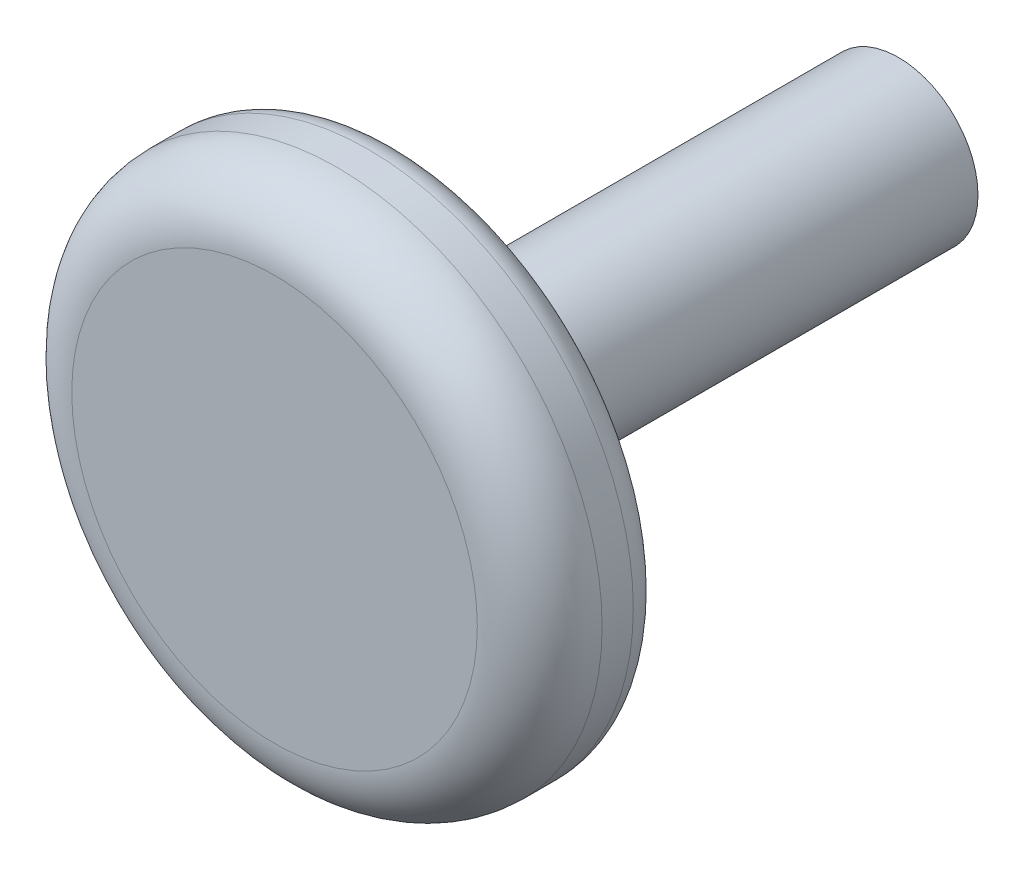
ISO-10303-21;
HEADER;
FILE_DESCRIPTION(('STEP AP214'),'2;1');
FILE_NAME('part.step','',(''),(''),'','','');
FILE_SCHEMA(('AUTOMOTIVE_DESIGN { 1 0 10303 214 1 1 1 1 }'));
ENDSEC;
DATA;
#1=APPLICATION_CONTEXT('core data for automotive mechanical design processes');
#2=APPLICATION_PROTOCOL_DEFINITION('international standard','automotive_design',2000,#1);
#3=PRODUCT_CONTEXT('',#1,'mechanical');
#4=PRODUCT('Part','Part','',(#3));
#5=PRODUCT_RELATED_PRODUCT_CATEGORY('part','',(#4));
#6=PRODUCT_DEFINITION_FORMATION('','',#4);
#7=PRODUCT_DEFINITION_CONTEXT('part definition',#1,'design');
#8=PRODUCT_DEFINITION('design','',#6,#7);
#9=PRODUCT_DEFINITION_SHAPE('','',#8);
#10=(LENGTH_UNIT() NAMED_UNIT(*) SI_UNIT(.MILLI.,.METRE.));
#11=(NAMED_UNIT(*) PLANE_ANGLE_UNIT() SI_UNIT($,.RADIAN.));
#12=(NAMED_UNIT(*) SI_UNIT($,.STERADIAN.) SOLID_ANGLE_UNIT());
#13=UNCERTAINTY_MEASURE_WITH_UNIT(LENGTH_MEASURE(1.E-05),#10,'distance_accuracy_value','');
#14=(GEOMETRIC_REPRESENTATION_CONTEXT(3) GLOBAL_UNCERTAINTY_ASSIGNED_CONTEXT((#13)) GLOBAL_UNIT_ASSIGNED_CONTEXT((#10,
#11,#12)) REPRESENTATION_CONTEXT('',''));
#15=CARTESIAN_POINT('',(0.,0.,0.));
#16=DIRECTION('',(0.,0.,1.));
#17=DIRECTION('',(1.,0.,0.));
#18=AXIS2_PLACEMENT_3D('',#15,#16,#17);
#19=CARTESIAN_POINT('',(0.,0.,80.));
#20=DIRECTION('',(0.,0.,-1.));
#21=DIRECTION('',(-1.,0.,0.));
#22=AXIS2_PLACEMENT_3D('',#19,#20,#21);
#23=CYLINDRICAL_SURFACE('',#22,12.75);
#24=CARTESIAN_POINT('',(0.,0.,70.));
#25=DIRECTION('',(0.,0.,1.));
#26=DIRECTION('',(1.,0.,0.));
#27=AXIS2_PLACEMENT_3D('',#24,#25,#26);
#28=CIRCLE('',#27,12.75);
#29=CARTESIAN_POINT('',(12.75,0.,70.));
#30=VERTEX_POINT('',#29);
#31=EDGE_CURVE('E42',#30,#30,#28,.F.);
#32=ORIENTED_EDGE('',*,*,#31,.T.);
#33=EDGE_LOOP('',(#32));
#34=FACE_BOUND('',#33,.T.);
#35=CARTESIAN_POINT('',(0.,0.,0.));
#36=DIRECTION('',(0.,0.,1.));
#37=DIRECTION('',(1.,0.,0.));
#38=AXIS2_PLACEMENT_3D('',#35,#36,#37);
#39=CIRCLE('',#38,12.75);
#40=CARTESIAN_POINT('',(12.75,0.,0.));
#41=VERTEX_POINT('',#40);
#42=EDGE_CURVE('E57',#41,#41,#39,.T.);
#43=ORIENTED_EDGE('',*,*,#42,.T.);
#44=EDGE_LOOP('',(#43));
#45=FACE_BOUND('',#44,.T.);
#46=ADVANCED_FACE('F31',(#34,#45),#23,.T.);
#47=CARTESIAN_POINT('',(0.,0.,0.));
#48=DIRECTION('',(0.,0.,1.));
#49=DIRECTION('',(1.,0.,0.));
#50=AXIS2_PLACEMENT_3D('',#47,#48,#49);
#51=PLANE('',#50);
#52=CARTESIAN_POINT('',(0.,0.,0.));
#53=DIRECTION('',(0.,0.,-1.));
#54=DIRECTION('',(-1.,0.,0.));
#55=AXIS2_PLACEMENT_3D('',#52,#53,#54);
#56=CIRCLE('',#55,10.25);
#57=CARTESIAN_POINT('',(-10.25,0.,0.));
#58=VERTEX_POINT('',#57);
#59=EDGE_CURVE('E61',#58,#58,#56,.T.);
#60=ORIENTED_EDGE('',*,*,#59,.F.);
#61=EDGE_LOOP('',(#60));
#62=FACE_BOUND('',#61,.T.);
#63=ORIENTED_EDGE('',*,*,#42,.F.);
#64=EDGE_LOOP('',(#63));
#65=FACE_BOUND('',#64,.T.);
#66=ADVANCED_FACE('F76',(#62,#65),#51,.F.);
#67=CARTESIAN_POINT('',(0.,0.,100.));
#68=DIRECTION('',(0.,0.,-1.));
#69=DIRECTION('',(-1.,0.,0.));
#70=AXIS2_PLACEMENT_3D('',#67,#68,#69);
#71=CYLINDRICAL_SURFACE('',#70,42.5);
#72=CARTESIAN_POINT('',(0.,0.,85.));
#73=DIRECTION('',(0.,0.,1.));
#74=DIRECTION('',(1.,0.,0.));
#75=AXIS2_PLACEMENT_3D('',#72,#73,#74);
#76=CIRCLE('',#75,42.5);
#77=CARTESIAN_POINT('',(42.5,0.,85.));
#78=VERTEX_POINT('',#77);
#79=EDGE_CURVE('E38',#78,#78,#76,.T.);
#80=ORIENTED_EDGE('',*,*,#79,.T.);
#81=EDGE_LOOP('',(#80));
#82=FACE_BOUND('',#81,.T.);
#83=CARTESIAN_POINT('',(0.,0.,90.));
#84=DIRECTION('',(0.,0.,1.));
#85=DIRECTION('',(1.,0.,0.));
#86=AXIS2_PLACEMENT_3D('',#83,#84,#85);
#87=CIRCLE('',#86,42.5);
#88=CARTESIAN_POINT('',(42.5,0.,90.));
#89=VERTEX_POINT('',#88);
#90=EDGE_CURVE('E51',#89,#89,#87,.F.);
#91=ORIENTED_EDGE('',*,*,#90,.T.);
#92=EDGE_LOOP('',(#91));
#93=FACE_BOUND('',#92,.T.);
#94=ADVANCED_FACE('F79',(#82,#93),#71,.T.);
#95=CARTESIAN_POINT('',(0.,0.,100.));
#96=DIRECTION('',(0.,0.,1.));
#97=DIRECTION('',(1.,0.,0.));
#98=AXIS2_PLACEMENT_3D('',#95,#96,#97);
#99=PLANE('',#98);
#100=CARTESIAN_POINT('',(0.,0.,100.));
#101=DIRECTION('',(0.,0.,1.));
#102=DIRECTION('',(1.,0.,0.));
#103=AXIS2_PLACEMENT_3D('',#100,#101,#102);
#104=CIRCLE('',#103,32.5);
#105=CARTESIAN_POINT('',(32.5,0.,100.));
#106=VERTEX_POINT('',#105);
#107=EDGE_CURVE('E54',#106,#106,#104,.T.);
#108=ORIENTED_EDGE('',*,*,#107,.T.);
#109=EDGE_LOOP('',(#108));
#110=FACE_BOUND('',#109,.T.);
#111=ADVANCED_FACE('F107',(#110),#99,.T.);
#112=CARTESIAN_POINT('',(0.,0.,80.));
#113=DIRECTION('',(0.,0.,1.));
#114=DIRECTION('',(1.,0.,0.));
#115=AXIS2_PLACEMENT_3D('',#112,#113,#114);
#116=PLANE('',#115);
#117=CARTESIAN_POINT('',(0.,0.,80.));
#118=DIRECTION('',(0.,0.,1.));
#119=DIRECTION('',(1.,0.,0.));
#120=AXIS2_PLACEMENT_3D('',#117,#118,#119);
#121=CIRCLE('',#120,37.5);
#122=CARTESIAN_POINT('',(37.5,0.,80.));
#123=VERTEX_POINT('',#122);
#124=EDGE_CURVE('E10',#123,#123,#121,.F.);
#125=ORIENTED_EDGE('',*,*,#124,.T.);
#126=EDGE_LOOP('',(#125));
#127=FACE_BOUND('',#126,.T.);
#128=CARTESIAN_POINT('',(0.,0.,80.));
#129=DIRECTION('',(0.,0.,1.));
#130=DIRECTION('',(1.,0.,0.));
#131=AXIS2_PLACEMENT_3D('',#128,#129,#130);
#132=CIRCLE('',#131,22.75);
#133=CARTESIAN_POINT('',(22.75,0.,80.));
#134=VERTEX_POINT('',#133);
#135=EDGE_CURVE('E46',#134,#134,#132,.T.);
#136=ORIENTED_EDGE('',*,*,#135,.T.);
#137=EDGE_LOOP('',(#136));
#138=FACE_BOUND('',#137,.T.);
#139=ADVANCED_FACE('F91',(#127,#138),#116,.F.);
#140=CARTESIAN_POINT('',(0.,0.,90.));
#141=DIRECTION('',(0.,0.,1.));
#142=DIRECTION('',(1.,0.,0.));
#143=AXIS2_PLACEMENT_3D('',#140,#141,#142);
#144=TOROIDAL_SURFACE('',#143,32.5,10.);
#145=ORIENTED_EDGE('',*,*,#90,.F.);
#146=EDGE_LOOP('',(#145));
#147=FACE_BOUND('',#146,.T.);
#148=ORIENTED_EDGE('',*,*,#107,.F.);
#149=EDGE_LOOP('',(#148));
#150=FACE_BOUND('',#149,.T.);
#151=ADVANCED_FACE('F72',(#147,#150),#144,.T.);
#152=CARTESIAN_POINT('',(0.,0.,10.));
#153=DIRECTION('',(0.,0.,-1.));
#154=DIRECTION('',(-1.,0.,0.));
#155=AXIS2_PLACEMENT_3D('',#152,#153,#154);
#156=CYLINDRICAL_SURFACE('',#155,10.25);
#157=CARTESIAN_POINT('',(0.,0.,10.));
#158=DIRECTION('',(0.,0.,-1.));
#159=DIRECTION('',(-1.,0.,0.));
#160=AXIS2_PLACEMENT_3D('',#157,#158,#159);
#161=CIRCLE('',#160,10.25);
#162=CARTESIAN_POINT('',(-10.25,0.,10.));
#163=VERTEX_POINT('',#162);
#164=EDGE_CURVE('E60',#163,#163,#161,.T.);
#165=ORIENTED_EDGE('',*,*,#164,.F.);
#166=EDGE_LOOP('',(#165));
#167=FACE_BOUND('',#166,.T.);
#168=ORIENTED_EDGE('',*,*,#59,.T.);
#169=EDGE_LOOP('',(#168));
#170=FACE_BOUND('',#169,.T.);
#171=ADVANCED_FACE('F69',(#167,#170),#156,.F.);
#172=CARTESIAN_POINT('',(0.,0.,10.));
#173=DIRECTION('',(0.,0.,-1.));
#174=DIRECTION('',(-1.,0.,0.));
#175=AXIS2_PLACEMENT_3D('',#172,#173,#174);
#176=PLANE('',#175);
#177=ORIENTED_EDGE('',*,*,#164,.T.);
#178=EDGE_LOOP('',(#177));
#179=FACE_BOUND('',#178,.T.);
#180=ADVANCED_FACE('F67',(#179),#176,.T.);
#181=CARTESIAN_POINT('',(0.,0.,70.));
#182=DIRECTION('',(0.,0.,1.));
#183=DIRECTION('',(1.,0.,0.));
#184=AXIS2_PLACEMENT_3D('',#181,#182,#183);
#185=TOROIDAL_SURFACE('',#184,22.75,10.);
#186=ORIENTED_EDGE('',*,*,#31,.F.);
#187=EDGE_LOOP('',(#186));
#188=FACE_BOUND('',#187,.T.);
#189=ORIENTED_EDGE('',*,*,#135,.F.);
#190=EDGE_LOOP('',(#189));
#191=FACE_BOUND('',#190,.T.);
#192=ADVANCED_FACE('F93',(#188,#191),#185,.F.);
#193=CARTESIAN_POINT('',(0.,0.,85.));
#194=DIRECTION('',(0.,0.,1.));
#195=DIRECTION('',(1.,0.,0.));
#196=AXIS2_PLACEMENT_3D('',#193,#194,#195);
#197=TOROIDAL_SURFACE('',#196,37.5,5.);
#198=ORIENTED_EDGE('',*,*,#124,.F.);
#199=EDGE_LOOP('',(#198));
#200=FACE_BOUND('',#199,.T.);
#201=ORIENTED_EDGE('',*,*,#79,.F.);
#202=EDGE_LOOP('',(#201));
#203=FACE_BOUND('',#202,.T.);
#204=ADVANCED_FACE('F33',(#200,#203),#197,.T.);
#205=CLOSED_SHELL('',(#46,#66,#94,#111,#139,#151,#171,#180,#192,#204));
#206=MANIFOLD_SOLID_BREP('B2',#205);
#207=ADVANCED_BREP_SHAPE_REPRESENTATION('',(#18,#206),#14);
#208=SHAPE_DEFINITION_REPRESENTATION(#9,#207);
ENDSEC;
END-ISO-10303-21;
